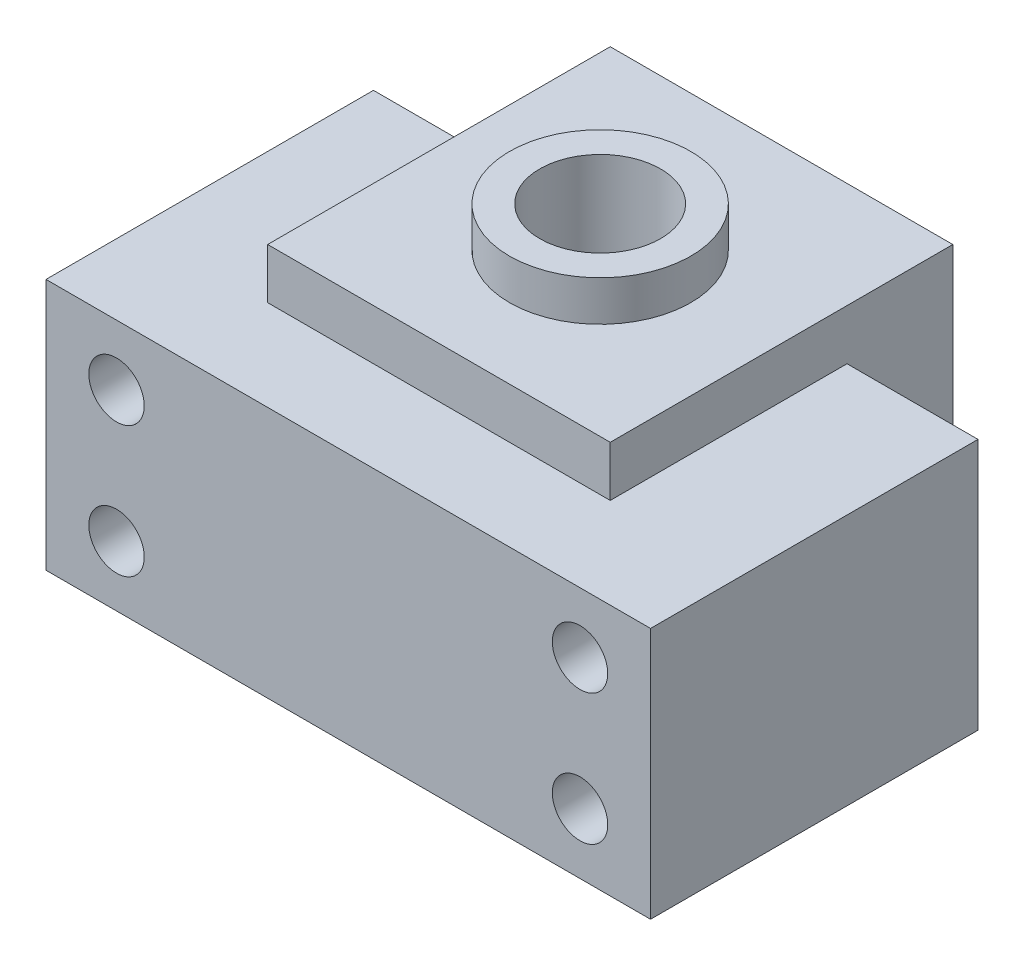
ISO-10303-21;
HEADER;
FILE_DESCRIPTION(('STEP AP214'),'2;1');
FILE_NAME('part.step','',(''),(''),'','','');
FILE_SCHEMA(('AUTOMOTIVE_DESIGN { 1 0 10303 214 1 1 1 1 }'));
ENDSEC;
DATA;
#1=APPLICATION_CONTEXT('core data for automotive mechanical design processes');
#2=APPLICATION_PROTOCOL_DEFINITION('international standard','automotive_design',2000,#1);
#3=PRODUCT_CONTEXT('',#1,'mechanical');
#4=PRODUCT('Part','Part','',(#3));
#5=PRODUCT_RELATED_PRODUCT_CATEGORY('part','',(#4));
#6=PRODUCT_DEFINITION_FORMATION('','',#4);
#7=PRODUCT_DEFINITION_CONTEXT('part definition',#1,'design');
#8=PRODUCT_DEFINITION('design','',#6,#7);
#9=PRODUCT_DEFINITION_SHAPE('','',#8);
#10=(LENGTH_UNIT() NAMED_UNIT(*) SI_UNIT(.MILLI.,.METRE.));
#11=(NAMED_UNIT(*) PLANE_ANGLE_UNIT() SI_UNIT($,.RADIAN.));
#12=(NAMED_UNIT(*) SI_UNIT($,.STERADIAN.) SOLID_ANGLE_UNIT());
#13=UNCERTAINTY_MEASURE_WITH_UNIT(LENGTH_MEASURE(1.E-05),#10,'distance_accuracy_value','');
#14=(GEOMETRIC_REPRESENTATION_CONTEXT(3) GLOBAL_UNCERTAINTY_ASSIGNED_CONTEXT((#13)) GLOBAL_UNIT_ASSIGNED_CONTEXT((#10,
#11,#12)) REPRESENTATION_CONTEXT('',''));
#15=CARTESIAN_POINT('',(0.,0.,0.));
#16=DIRECTION('',(0.,0.,1.));
#17=DIRECTION('',(1.,0.,0.));
#18=AXIS2_PLACEMENT_3D('',#15,#16,#17);
#19=CARTESIAN_POINT('',(0.,30.,0.));
#20=DIRECTION('',(0.,1.,0.));
#21=DIRECTION('',(0.,0.,1.));
#22=AXIS2_PLACEMENT_3D('',#19,#20,#21);
#23=PLANE('',#22);
#24=DIRECTION('',(0.,0.,1.));
#25=VECTOR('',#24,1.);
#26=CARTESIAN_POINT('',(-17.,30.,-21.5));
#27=LINE('',#26,#25);
#28=CARTESIAN_POINT('',(-17.,30.,-21.5));
#29=VERTEX_POINT('',#28);
#30=CARTESIAN_POINT('',(-17.,30.,12.5));
#31=VERTEX_POINT('',#30);
#32=EDGE_CURVE('E206',#29,#31,#27,.T.);
#33=ORIENTED_EDGE('',*,*,#32,.T.);
#34=DIRECTION('',(1.,0.,0.));
#35=VECTOR('',#34,1.);
#36=CARTESIAN_POINT('',(-17.,30.,12.5));
#37=LINE('',#36,#35);
#38=CARTESIAN_POINT('',(17.,30.,12.5));
#39=VERTEX_POINT('',#38);
#40=EDGE_CURVE('E201',#31,#39,#37,.T.);
#41=ORIENTED_EDGE('',*,*,#40,.T.);
#42=DIRECTION('',(0.,0.,-1.));
#43=VECTOR('',#42,1.);
#44=CARTESIAN_POINT('',(17.,30.,-21.5));
#45=LINE('',#44,#43);
#46=CARTESIAN_POINT('',(17.,30.,-21.5));
#47=VERTEX_POINT('',#46);
#48=EDGE_CURVE('E193',#39,#47,#45,.T.);
#49=ORIENTED_EDGE('',*,*,#48,.T.);
#50=DIRECTION('',(-1.,0.,0.));
#51=VECTOR('',#50,1.);
#52=CARTESIAN_POINT('',(-17.,30.,-21.5));
#53=LINE('',#52,#51);
#54=EDGE_CURVE('E189',#47,#29,#53,.T.);
#55=ORIENTED_EDGE('',*,*,#54,.T.);
#56=EDGE_LOOP('',(#33,#41,#49,#55));
#57=FACE_BOUND('',#56,.T.);
#58=CARTESIAN_POINT('',(0.,30.,-3.5));
#59=DIRECTION('',(0.,1.,0.));
#60=DIRECTION('',(0.,0.,1.));
#61=AXIS2_PLACEMENT_3D('',#58,#59,#60);
#62=CIRCLE('',#61,9.);
#63=CARTESIAN_POINT('',(0.,30.,5.5));
#64=VERTEX_POINT('',#63);
#65=EDGE_CURVE('E254',#64,#64,#62,.T.);
#66=ORIENTED_EDGE('',*,*,#65,.F.);
#67=EDGE_LOOP('',(#66));
#68=FACE_BOUND('',#67,.T.);
#69=ADVANCED_FACE('F33',(#57,#68),#23,.T.);
#70=CARTESIAN_POINT('',(0.,25.,0.));
#71=DIRECTION('',(0.,-1.,0.));
#72=DIRECTION('',(0.,0.,-1.));
#73=AXIS2_PLACEMENT_3D('',#70,#71,#72);
#74=PLANE('',#73);
#75=DIRECTION('',(0.,0.,1.));
#76=VECTOR('',#75,1.);
#77=CARTESIAN_POINT('',(-17.,25.,-21.5));
#78=LINE('',#77,#76);
#79=CARTESIAN_POINT('',(-17.,25.,-11.));
#80=VERTEX_POINT('',#79);
#81=CARTESIAN_POINT('',(-17.,25.,12.5));
#82=VERTEX_POINT('',#81);
#83=EDGE_CURVE('E11',#80,#82,#78,.T.);
#84=ORIENTED_EDGE('',*,*,#83,.F.);
#85=DIRECTION('',(-1.,0.,0.));
#86=VECTOR('',#85,1.);
#87=CARTESIAN_POINT('',(-30.,25.,-11.));
#88=LINE('',#87,#86);
#89=CARTESIAN_POINT('',(-30.,25.,-11.));
#90=VERTEX_POINT('',#89);
#91=EDGE_CURVE('E148',#80,#90,#88,.T.);
#92=ORIENTED_EDGE('',*,*,#91,.T.);
#93=DIRECTION('',(0.,0.,1.));
#94=VECTOR('',#93,1.);
#95=CARTESIAN_POINT('',(-30.,25.,21.5));
#96=LINE('',#95,#94);
#97=CARTESIAN_POINT('',(-30.,25.,21.5));
#98=VERTEX_POINT('',#97);
#99=EDGE_CURVE('E111',#90,#98,#96,.T.);
#100=ORIENTED_EDGE('',*,*,#99,.T.);
#101=DIRECTION('',(1.,0.,0.));
#102=VECTOR('',#101,1.);
#103=CARTESIAN_POINT('',(30.,25.,21.5));
#104=LINE('',#103,#102);
#105=CARTESIAN_POINT('',(30.,25.,21.5));
#106=VERTEX_POINT('',#105);
#107=EDGE_CURVE('E104',#98,#106,#104,.T.);
#108=ORIENTED_EDGE('',*,*,#107,.T.);
#109=DIRECTION('',(0.,0.,-1.));
#110=VECTOR('',#109,1.);
#111=CARTESIAN_POINT('',(30.,25.,21.5));
#112=LINE('',#111,#110);
#113=CARTESIAN_POINT('',(30.,25.,-11.));
#114=VERTEX_POINT('',#113);
#115=EDGE_CURVE('E108',#106,#114,#112,.T.);
#116=ORIENTED_EDGE('',*,*,#115,.T.);
#117=DIRECTION('',(-1.,0.,0.));
#118=VECTOR('',#117,1.);
#119=CARTESIAN_POINT('',(30.,25.,-11.));
#120=LINE('',#119,#118);
#121=CARTESIAN_POINT('',(17.,25.,-11.));
#122=VERTEX_POINT('',#121);
#123=EDGE_CURVE('E56',#114,#122,#120,.T.);
#124=ORIENTED_EDGE('',*,*,#123,.T.);
#125=DIRECTION('',(0.,0.,-1.));
#126=VECTOR('',#125,1.);
#127=CARTESIAN_POINT('',(17.,25.,-21.5));
#128=LINE('',#127,#126);
#129=CARTESIAN_POINT('',(17.,25.,12.5));
#130=VERTEX_POINT('',#129);
#131=EDGE_CURVE('E177',#130,#122,#128,.T.);
#132=ORIENTED_EDGE('',*,*,#131,.F.);
#133=DIRECTION('',(1.,0.,0.));
#134=VECTOR('',#133,1.);
#135=CARTESIAN_POINT('',(-17.,25.,12.5));
#136=LINE('',#135,#134);
#137=EDGE_CURVE('E50',#82,#130,#136,.T.);
#138=ORIENTED_EDGE('',*,*,#137,.F.);
#139=EDGE_LOOP('',(#84,#92,#100,#108,#116,#124,#132,#138));
#140=FACE_BOUND('',#139,.T.);
#141=ADVANCED_FACE('F106',(#140),#74,.F.);
#142=CARTESIAN_POINT('',(0.,0.,0.));
#143=DIRECTION('',(0.,-1.,0.));
#144=DIRECTION('',(0.,0.,-1.));
#145=AXIS2_PLACEMENT_3D('',#142,#143,#144);
#146=PLANE('',#145);
#147=DIRECTION('',(0.,0.,-1.));
#148=VECTOR('',#147,1.);
#149=CARTESIAN_POINT('',(17.,0.,-21.5));
#150=LINE('',#149,#148);
#151=CARTESIAN_POINT('',(17.,0.,-11.));
#152=VERTEX_POINT('',#151);
#153=CARTESIAN_POINT('',(17.,0.,-21.5));
#154=VERTEX_POINT('',#153);
#155=EDGE_CURVE('E132',#152,#154,#150,.T.);
#156=ORIENTED_EDGE('',*,*,#155,.F.);
#157=DIRECTION('',(-1.,0.,0.));
#158=VECTOR('',#157,1.);
#159=CARTESIAN_POINT('',(30.,0.,-11.));
#160=LINE('',#159,#158);
#161=CARTESIAN_POINT('',(30.,0.,-11.));
#162=VERTEX_POINT('',#161);
#163=EDGE_CURVE('E89',#162,#152,#160,.T.);
#164=ORIENTED_EDGE('',*,*,#163,.F.);
#165=DIRECTION('',(0.,0.,-1.));
#166=VECTOR('',#165,1.);
#167=CARTESIAN_POINT('',(30.,0.,21.5));
#168=LINE('',#167,#166);
#169=CARTESIAN_POINT('',(30.,0.,21.5));
#170=VERTEX_POINT('',#169);
#171=EDGE_CURVE('E145',#170,#162,#168,.T.);
#172=ORIENTED_EDGE('',*,*,#171,.F.);
#173=DIRECTION('',(1.,0.,0.));
#174=VECTOR('',#173,1.);
#175=CARTESIAN_POINT('',(30.,0.,21.5));
#176=LINE('',#175,#174);
#177=CARTESIAN_POINT('',(-30.,0.,21.5));
#178=VERTEX_POINT('',#177);
#179=EDGE_CURVE('E120',#178,#170,#176,.T.);
#180=ORIENTED_EDGE('',*,*,#179,.F.);
#181=DIRECTION('',(0.,0.,1.));
#182=VECTOR('',#181,1.);
#183=CARTESIAN_POINT('',(-30.,0.,21.5));
#184=LINE('',#183,#182);
#185=CARTESIAN_POINT('',(-30.,0.,-11.));
#186=VERTEX_POINT('',#185);
#187=EDGE_CURVE('E142',#186,#178,#184,.T.);
#188=ORIENTED_EDGE('',*,*,#187,.F.);
#189=DIRECTION('',(-1.,0.,0.));
#190=VECTOR('',#189,1.);
#191=CARTESIAN_POINT('',(-30.,0.,-11.));
#192=LINE('',#191,#190);
#193=CARTESIAN_POINT('',(-17.,0.,-11.));
#194=VERTEX_POINT('',#193);
#195=EDGE_CURVE('E140',#194,#186,#192,.T.);
#196=ORIENTED_EDGE('',*,*,#195,.F.);
#197=DIRECTION('',(0.,0.,1.));
#198=VECTOR('',#197,1.);
#199=CARTESIAN_POINT('',(-17.,0.,-21.5));
#200=LINE('',#199,#198);
#201=CARTESIAN_POINT('',(-17.,0.,-21.5));
#202=VERTEX_POINT('',#201);
#203=EDGE_CURVE('E138',#202,#194,#200,.T.);
#204=ORIENTED_EDGE('',*,*,#203,.F.);
#205=DIRECTION('',(-1.,0.,0.));
#206=VECTOR('',#205,1.);
#207=CARTESIAN_POINT('',(17.,0.,-21.5));
#208=LINE('',#207,#206);
#209=EDGE_CURVE('E135',#154,#202,#208,.T.);
#210=ORIENTED_EDGE('',*,*,#209,.F.);
#211=EDGE_LOOP('',(#156,#164,#172,#180,#188,#196,#204,#210));
#212=FACE_BOUND('',#211,.T.);
#213=CARTESIAN_POINT('',(0.,0.,-3.5));
#214=DIRECTION('',(0.,1.,0.));
#215=DIRECTION('',(0.,0.,1.));
#216=AXIS2_PLACEMENT_3D('',#213,#214,#215);
#217=CIRCLE('',#216,6.);
#218=CARTESIAN_POINT('',(0.,0.,2.5));
#219=VERTEX_POINT('',#218);
#220=EDGE_CURVE('E136',#219,#219,#217,.T.);
#221=ORIENTED_EDGE('',*,*,#220,.T.);
#222=EDGE_LOOP('',(#221));
#223=FACE_BOUND('',#222,.T.);
#224=ADVANCED_FACE('F179',(#212,#223),#146,.T.);
#225=CARTESIAN_POINT('',(17.,25.,-21.5));
#226=DIRECTION('',(-1.,0.,0.));
#227=DIRECTION('',(0.,0.,1.));
#228=AXIS2_PLACEMENT_3D('',#225,#226,#227);
#229=PLANE('',#228);
#230=ORIENTED_EDGE('',*,*,#155,.T.);
#231=DIRECTION('',(0.,-1.,0.));
#232=VECTOR('',#231,1.);
#233=CARTESIAN_POINT('',(17.,25.,-21.5));
#234=LINE('',#233,#232);
#235=EDGE_CURVE('E42',#47,#154,#234,.T.);
#236=ORIENTED_EDGE('',*,*,#235,.F.);
#237=ORIENTED_EDGE('',*,*,#48,.F.);
#238=DIRECTION('',(0.,-1.,0.));
#239=VECTOR('',#238,1.);
#240=CARTESIAN_POINT('',(17.,30.,12.5));
#241=LINE('',#240,#239);
#242=EDGE_CURVE('E204',#39,#130,#241,.T.);
#243=ORIENTED_EDGE('',*,*,#242,.T.);
#244=ORIENTED_EDGE('',*,*,#131,.T.);
#245=DIRECTION('',(0.,-1.,0.));
#246=VECTOR('',#245,1.);
#247=CARTESIAN_POINT('',(17.,25.,-11.));
#248=LINE('',#247,#246);
#249=EDGE_CURVE('E128',#122,#152,#248,.T.);
#250=ORIENTED_EDGE('',*,*,#249,.T.);
#251=EDGE_LOOP('',(#230,#236,#237,#243,#244,#250));
#252=FACE_BOUND('',#251,.T.);
#253=ADVANCED_FACE('F35',(#252),#229,.F.);
#254=CARTESIAN_POINT('',(17.,25.,-21.5));
#255=DIRECTION('',(0.,0.,1.));
#256=DIRECTION('',(1.,0.,0.));
#257=AXIS2_PLACEMENT_3D('',#254,#255,#256);
#258=PLANE('',#257);
#259=ORIENTED_EDGE('',*,*,#209,.T.);
#260=DIRECTION('',(0.,-1.,0.));
#261=VECTOR('',#260,1.);
#262=CARTESIAN_POINT('',(-17.,25.,-21.5));
#263=LINE('',#262,#261);
#264=EDGE_CURVE('E155',#29,#202,#263,.T.);
#265=ORIENTED_EDGE('',*,*,#264,.F.);
#266=ORIENTED_EDGE('',*,*,#54,.F.);
#267=ORIENTED_EDGE('',*,*,#235,.T.);
#268=EDGE_LOOP('',(#259,#265,#266,#267));
#269=FACE_BOUND('',#268,.T.);
#270=ADVANCED_FACE('F186',(#269),#258,.F.);
#271=CARTESIAN_POINT('',(-17.,25.,-21.5));
#272=DIRECTION('',(1.,0.,0.));
#273=DIRECTION('',(0.,0.,-1.));
#274=AXIS2_PLACEMENT_3D('',#271,#272,#273);
#275=PLANE('',#274);
#276=ORIENTED_EDGE('',*,*,#203,.T.);
#277=DIRECTION('',(0.,-1.,0.));
#278=VECTOR('',#277,1.);
#279=CARTESIAN_POINT('',(-17.,25.,-11.));
#280=LINE('',#279,#278);
#281=EDGE_CURVE('E154',#80,#194,#280,.T.);
#282=ORIENTED_EDGE('',*,*,#281,.F.);
#283=ORIENTED_EDGE('',*,*,#83,.T.);
#284=DIRECTION('',(0.,-1.,0.));
#285=VECTOR('',#284,1.);
#286=CARTESIAN_POINT('',(-17.,30.,12.5));
#287=LINE('',#286,#285);
#288=EDGE_CURVE('E213',#31,#82,#287,.T.);
#289=ORIENTED_EDGE('',*,*,#288,.F.);
#290=ORIENTED_EDGE('',*,*,#32,.F.);
#291=ORIENTED_EDGE('',*,*,#264,.T.);
#292=EDGE_LOOP('',(#276,#282,#283,#289,#290,#291));
#293=FACE_BOUND('',#292,.T.);
#294=ADVANCED_FACE('F264',(#293),#275,.F.);
#295=CARTESIAN_POINT('',(-30.,25.,-11.));
#296=DIRECTION('',(0.,0.,1.));
#297=DIRECTION('',(1.,0.,0.));
#298=AXIS2_PLACEMENT_3D('',#295,#296,#297);
#299=PLANE('',#298);
#300=CARTESIAN_POINT('',(-23.,19.,-11.));
#301=DIRECTION('',(0.,0.,-1.));
#302=DIRECTION('',(1.,0.,0.));
#303=AXIS2_PLACEMENT_3D('',#300,#301,#302);
#304=CIRCLE('',#303,2.75);
#305=CARTESIAN_POINT('',(-20.25,19.,-11.));
#306=VERTEX_POINT('',#305);
#307=EDGE_CURVE('E216',#306,#306,#304,.T.);
#308=ORIENTED_EDGE('',*,*,#307,.F.);
#309=EDGE_LOOP('',(#308));
#310=FACE_BOUND('',#309,.T.);
#311=CARTESIAN_POINT('',(-23.,6.,-11.));
#312=DIRECTION('',(0.,0.,-1.));
#313=DIRECTION('',(1.,0.,0.));
#314=AXIS2_PLACEMENT_3D('',#311,#312,#313);
#315=CIRCLE('',#314,2.75);
#316=CARTESIAN_POINT('',(-20.25,6.,-11.));
#317=VERTEX_POINT('',#316);
#318=EDGE_CURVE('E221',#317,#317,#315,.T.);
#319=ORIENTED_EDGE('',*,*,#318,.F.);
#320=EDGE_LOOP('',(#319));
#321=FACE_BOUND('',#320,.T.);
#322=ORIENTED_EDGE('',*,*,#195,.T.);
#323=DIRECTION('',(0.,-1.,0.));
#324=VECTOR('',#323,1.);
#325=CARTESIAN_POINT('',(-30.,25.,-11.));
#326=LINE('',#325,#324);
#327=EDGE_CURVE('E151',#90,#186,#326,.T.);
#328=ORIENTED_EDGE('',*,*,#327,.F.);
#329=ORIENTED_EDGE('',*,*,#91,.F.);
#330=ORIENTED_EDGE('',*,*,#281,.T.);
#331=EDGE_LOOP('',(#322,#328,#329,#330));
#332=FACE_BOUND('',#331,.T.);
#333=ADVANCED_FACE('F270',(#310,#321,#332),#299,.F.);
#334=CARTESIAN_POINT('',(-30.,25.,21.5));
#335=DIRECTION('',(1.,0.,0.));
#336=DIRECTION('',(0.,0.,-1.));
#337=AXIS2_PLACEMENT_3D('',#334,#335,#336);
#338=PLANE('',#337);
#339=ORIENTED_EDGE('',*,*,#187,.T.);
#340=DIRECTION('',(0.,-1.,0.));
#341=VECTOR('',#340,1.);
#342=CARTESIAN_POINT('',(-30.,25.,21.5));
#343=LINE('',#342,#341);
#344=EDGE_CURVE('E123',#98,#178,#343,.T.);
#345=ORIENTED_EDGE('',*,*,#344,.F.);
#346=ORIENTED_EDGE('',*,*,#99,.F.);
#347=ORIENTED_EDGE('',*,*,#327,.T.);
#348=EDGE_LOOP('',(#339,#345,#346,#347));
#349=FACE_BOUND('',#348,.T.);
#350=ADVANCED_FACE('F274',(#349),#338,.F.);
#351=CARTESIAN_POINT('',(30.,25.,21.5));
#352=DIRECTION('',(0.,0.,-1.));
#353=DIRECTION('',(-1.,0.,0.));
#354=AXIS2_PLACEMENT_3D('',#351,#352,#353);
#355=PLANE('',#354);
#356=CARTESIAN_POINT('',(-23.,19.,21.5));
#357=DIRECTION('',(0.,0.,-1.));
#358=DIRECTION('',(1.,0.,0.));
#359=AXIS2_PLACEMENT_3D('',#356,#357,#358);
#360=CIRCLE('',#359,2.75);
#361=CARTESIAN_POINT('',(-20.25,19.,21.5));
#362=VERTEX_POINT('',#361);
#363=EDGE_CURVE('E218',#362,#362,#360,.T.);
#364=ORIENTED_EDGE('',*,*,#363,.T.);
#365=EDGE_LOOP('',(#364));
#366=FACE_BOUND('',#365,.T.);
#367=CARTESIAN_POINT('',(-23.,6.,21.5));
#368=DIRECTION('',(0.,0.,-1.));
#369=DIRECTION('',(1.,0.,0.));
#370=AXIS2_PLACEMENT_3D('',#367,#368,#369);
#371=CIRCLE('',#370,2.75);
#372=CARTESIAN_POINT('',(-20.25,6.,21.5));
#373=VERTEX_POINT('',#372);
#374=EDGE_CURVE('E224',#373,#373,#371,.T.);
#375=ORIENTED_EDGE('',*,*,#374,.T.);
#376=EDGE_LOOP('',(#375));
#377=FACE_BOUND('',#376,.T.);
#378=CARTESIAN_POINT('',(23.,6.,21.5));
#379=DIRECTION('',(0.,0.,-1.));
#380=DIRECTION('',(-1.,0.,0.));
#381=AXIS2_PLACEMENT_3D('',#378,#379,#380);
#382=CIRCLE('',#381,2.75);
#383=CARTESIAN_POINT('',(20.25,6.,21.5));
#384=VERTEX_POINT('',#383);
#385=EDGE_CURVE('E230',#384,#384,#382,.T.);
#386=ORIENTED_EDGE('',*,*,#385,.T.);
#387=EDGE_LOOP('',(#386));
#388=FACE_BOUND('',#387,.T.);
#389=CARTESIAN_POINT('',(23.,19.,21.5));
#390=DIRECTION('',(0.,0.,-1.));
#391=DIRECTION('',(-1.,0.,0.));
#392=AXIS2_PLACEMENT_3D('',#389,#390,#391);
#393=CIRCLE('',#392,2.75);
#394=CARTESIAN_POINT('',(20.25,19.,21.5));
#395=VERTEX_POINT('',#394);
#396=EDGE_CURVE('E236',#395,#395,#393,.T.);
#397=ORIENTED_EDGE('',*,*,#396,.T.);
#398=EDGE_LOOP('',(#397));
#399=FACE_BOUND('',#398,.T.);
#400=ORIENTED_EDGE('',*,*,#179,.T.);
#401=DIRECTION('',(0.,-1.,0.));
#402=VECTOR('',#401,1.);
#403=CARTESIAN_POINT('',(30.,25.,21.5));
#404=LINE('',#403,#402);
#405=EDGE_CURVE('E117',#106,#170,#404,.T.);
#406=ORIENTED_EDGE('',*,*,#405,.F.);
#407=ORIENTED_EDGE('',*,*,#107,.F.);
#408=ORIENTED_EDGE('',*,*,#344,.T.);
#409=EDGE_LOOP('',(#400,#406,#407,#408));
#410=FACE_BOUND('',#409,.T.);
#411=ADVANCED_FACE('F118',(#366,#377,#388,#399,#410),#355,.F.);
#412=CARTESIAN_POINT('',(30.,25.,21.5));
#413=DIRECTION('',(-1.,0.,0.));
#414=DIRECTION('',(0.,0.,1.));
#415=AXIS2_PLACEMENT_3D('',#412,#413,#414);
#416=PLANE('',#415);
#417=ORIENTED_EDGE('',*,*,#171,.T.);
#418=DIRECTION('',(0.,-1.,0.));
#419=VECTOR('',#418,1.);
#420=CARTESIAN_POINT('',(30.,25.,-11.));
#421=LINE('',#420,#419);
#422=EDGE_CURVE('E124',#114,#162,#421,.T.);
#423=ORIENTED_EDGE('',*,*,#422,.F.);
#424=ORIENTED_EDGE('',*,*,#115,.F.);
#425=ORIENTED_EDGE('',*,*,#405,.T.);
#426=EDGE_LOOP('',(#417,#423,#424,#425));
#427=FACE_BOUND('',#426,.T.);
#428=ADVANCED_FACE('F126',(#427),#416,.F.);
#429=CARTESIAN_POINT('',(30.,25.,-11.));
#430=DIRECTION('',(0.,0.,1.));
#431=DIRECTION('',(1.,0.,0.));
#432=AXIS2_PLACEMENT_3D('',#429,#430,#431);
#433=PLANE('',#432);
#434=CARTESIAN_POINT('',(23.,6.,-11.));
#435=DIRECTION('',(0.,0.,-1.));
#436=DIRECTION('',(-1.,0.,0.));
#437=AXIS2_PLACEMENT_3D('',#434,#435,#436);
#438=CIRCLE('',#437,2.75);
#439=CARTESIAN_POINT('',(20.25,6.,-11.));
#440=VERTEX_POINT('',#439);
#441=EDGE_CURVE('E227',#440,#440,#438,.T.);
#442=ORIENTED_EDGE('',*,*,#441,.F.);
#443=EDGE_LOOP('',(#442));
#444=FACE_BOUND('',#443,.T.);
#445=CARTESIAN_POINT('',(23.,19.,-11.));
#446=DIRECTION('',(0.,0.,-1.));
#447=DIRECTION('',(-1.,0.,0.));
#448=AXIS2_PLACEMENT_3D('',#445,#446,#447);
#449=CIRCLE('',#448,2.75);
#450=CARTESIAN_POINT('',(20.25,19.,-11.));
#451=VERTEX_POINT('',#450);
#452=EDGE_CURVE('E233',#451,#451,#449,.T.);
#453=ORIENTED_EDGE('',*,*,#452,.F.);
#454=EDGE_LOOP('',(#453));
#455=FACE_BOUND('',#454,.T.);
#456=ORIENTED_EDGE('',*,*,#163,.T.);
#457=ORIENTED_EDGE('',*,*,#249,.F.);
#458=ORIENTED_EDGE('',*,*,#123,.F.);
#459=ORIENTED_EDGE('',*,*,#422,.T.);
#460=EDGE_LOOP('',(#456,#457,#458,#459));
#461=FACE_BOUND('',#460,.T.);
#462=ADVANCED_FACE('F248',(#444,#455,#461),#433,.F.);
#463=CARTESIAN_POINT('',(0.,25.,-3.5));
#464=DIRECTION('',(0.,-1.,0.));
#465=DIRECTION('',(0.,0.,-1.));
#466=AXIS2_PLACEMENT_3D('',#463,#464,#465);
#467=CYLINDRICAL_SURFACE('',#466,6.);
#468=ORIENTED_EDGE('',*,*,#220,.F.);
#469=EDGE_LOOP('',(#468));
#470=FACE_BOUND('',#469,.T.);
#471=CARTESIAN_POINT('',(0.,34.,-3.5));
#472=DIRECTION('',(0.,1.,0.));
#473=DIRECTION('',(0.,0.,1.));
#474=AXIS2_PLACEMENT_3D('',#471,#472,#473);
#475=CIRCLE('',#474,6.);
#476=CARTESIAN_POINT('',(0.,34.,2.5));
#477=VERTEX_POINT('',#476);
#478=EDGE_CURVE('E252',#477,#477,#475,.T.);
#479=ORIENTED_EDGE('',*,*,#478,.T.);
#480=EDGE_LOOP('',(#479));
#481=FACE_BOUND('',#480,.T.);
#482=ADVANCED_FACE('F244',(#470,#481),#467,.F.);
#483=CARTESIAN_POINT('',(23.,19.,21.5));
#484=DIRECTION('',(0.,0.,-1.));
#485=DIRECTION('',(-1.,0.,0.));
#486=AXIS2_PLACEMENT_3D('',#483,#484,#485);
#487=CYLINDRICAL_SURFACE('',#486,2.75);
#488=ORIENTED_EDGE('',*,*,#396,.F.);
#489=EDGE_LOOP('',(#488));
#490=FACE_BOUND('',#489,.T.);
#491=ORIENTED_EDGE('',*,*,#452,.T.);
#492=EDGE_LOOP('',(#491));
#493=FACE_BOUND('',#492,.T.);
#494=ADVANCED_FACE('F247',(#490,#493),#487,.F.);
#495=CARTESIAN_POINT('',(23.,6.,21.5));
#496=DIRECTION('',(0.,0.,-1.));
#497=DIRECTION('',(-1.,0.,0.));
#498=AXIS2_PLACEMENT_3D('',#495,#496,#497);
#499=CYLINDRICAL_SURFACE('',#498,2.75);
#500=ORIENTED_EDGE('',*,*,#385,.F.);
#501=EDGE_LOOP('',(#500));
#502=FACE_BOUND('',#501,.T.);
#503=ORIENTED_EDGE('',*,*,#441,.T.);
#504=EDGE_LOOP('',(#503));
#505=FACE_BOUND('',#504,.T.);
#506=ADVANCED_FACE('F305',(#502,#505),#499,.F.);
#507=CARTESIAN_POINT('',(-23.,6.,21.5));
#508=DIRECTION('',(0.,0.,-1.));
#509=DIRECTION('',(-1.,0.,0.));
#510=AXIS2_PLACEMENT_3D('',#507,#508,#509);
#511=CYLINDRICAL_SURFACE('',#510,2.75);
#512=ORIENTED_EDGE('',*,*,#374,.F.);
#513=EDGE_LOOP('',(#512));
#514=FACE_BOUND('',#513,.T.);
#515=ORIENTED_EDGE('',*,*,#318,.T.);
#516=EDGE_LOOP('',(#515));
#517=FACE_BOUND('',#516,.T.);
#518=ADVANCED_FACE('F301',(#514,#517),#511,.F.);
#519=CARTESIAN_POINT('',(-23.,19.,21.5));
#520=DIRECTION('',(0.,0.,-1.));
#521=DIRECTION('',(-1.,0.,0.));
#522=AXIS2_PLACEMENT_3D('',#519,#520,#521);
#523=CYLINDRICAL_SURFACE('',#522,2.75);
#524=ORIENTED_EDGE('',*,*,#363,.F.);
#525=EDGE_LOOP('',(#524));
#526=FACE_BOUND('',#525,.T.);
#527=ORIENTED_EDGE('',*,*,#307,.T.);
#528=EDGE_LOOP('',(#527));
#529=FACE_BOUND('',#528,.T.);
#530=ADVANCED_FACE('F298',(#526,#529),#523,.F.);
#531=CARTESIAN_POINT('',(-17.,30.,12.5));
#532=DIRECTION('',(0.,0.,-1.));
#533=DIRECTION('',(-1.,0.,0.));
#534=AXIS2_PLACEMENT_3D('',#531,#532,#533);
#535=PLANE('',#534);
#536=ORIENTED_EDGE('',*,*,#137,.T.);
#537=ORIENTED_EDGE('',*,*,#242,.F.);
#538=ORIENTED_EDGE('',*,*,#40,.F.);
#539=ORIENTED_EDGE('',*,*,#288,.T.);
#540=EDGE_LOOP('',(#536,#537,#538,#539));
#541=FACE_BOUND('',#540,.T.);
#542=ADVANCED_FACE('F266',(#541),#535,.F.);
#543=CARTESIAN_POINT('',(0.,34.,-3.5));
#544=DIRECTION('',(0.,1.,0.));
#545=DIRECTION('',(0.,0.,1.));
#546=AXIS2_PLACEMENT_3D('',#543,#544,#545);
#547=PLANE('',#546);
#548=CARTESIAN_POINT('',(0.,34.,-3.5));
#549=DIRECTION('',(0.,1.,0.));
#550=DIRECTION('',(0.,0.,1.));
#551=AXIS2_PLACEMENT_3D('',#548,#549,#550);
#552=CIRCLE('',#551,9.);
#553=CARTESIAN_POINT('',(0.,34.,5.5));
#554=VERTEX_POINT('',#553);
#555=EDGE_CURVE('E211',#554,#554,#552,.T.);
#556=ORIENTED_EDGE('',*,*,#555,.T.);
#557=EDGE_LOOP('',(#556));
#558=FACE_BOUND('',#557,.T.);
#559=ORIENTED_EDGE('',*,*,#478,.F.);
#560=EDGE_LOOP('',(#559));
#561=FACE_BOUND('',#560,.T.);
#562=ADVANCED_FACE('F297',(#558,#561),#547,.T.);
#563=CARTESIAN_POINT('',(0.,34.,-3.5));
#564=DIRECTION('',(0.,-1.,0.));
#565=DIRECTION('',(0.,0.,-1.));
#566=AXIS2_PLACEMENT_3D('',#563,#564,#565);
#567=CYLINDRICAL_SURFACE('',#566,9.);
#568=ORIENTED_EDGE('',*,*,#555,.F.);
#569=EDGE_LOOP('',(#568));
#570=FACE_BOUND('',#569,.T.);
#571=ORIENTED_EDGE('',*,*,#65,.T.);
#572=EDGE_LOOP('',(#571));
#573=FACE_BOUND('',#572,.T.);
#574=ADVANCED_FACE('F293',(#570,#573),#567,.T.);
#575=CLOSED_SHELL('',(#69,#141,#224,#253,#270,#294,#333,#350,#411,#428,#462,#482,#494,#506,#518,
#530,#542,#562,#574));
#576=MANIFOLD_SOLID_BREP('B2',#575);
#577=ADVANCED_BREP_SHAPE_REPRESENTATION('',(#18,#576),#14);
#578=SHAPE_DEFINITION_REPRESENTATION(#9,#577);
ENDSEC;
END-ISO-10303-21;
